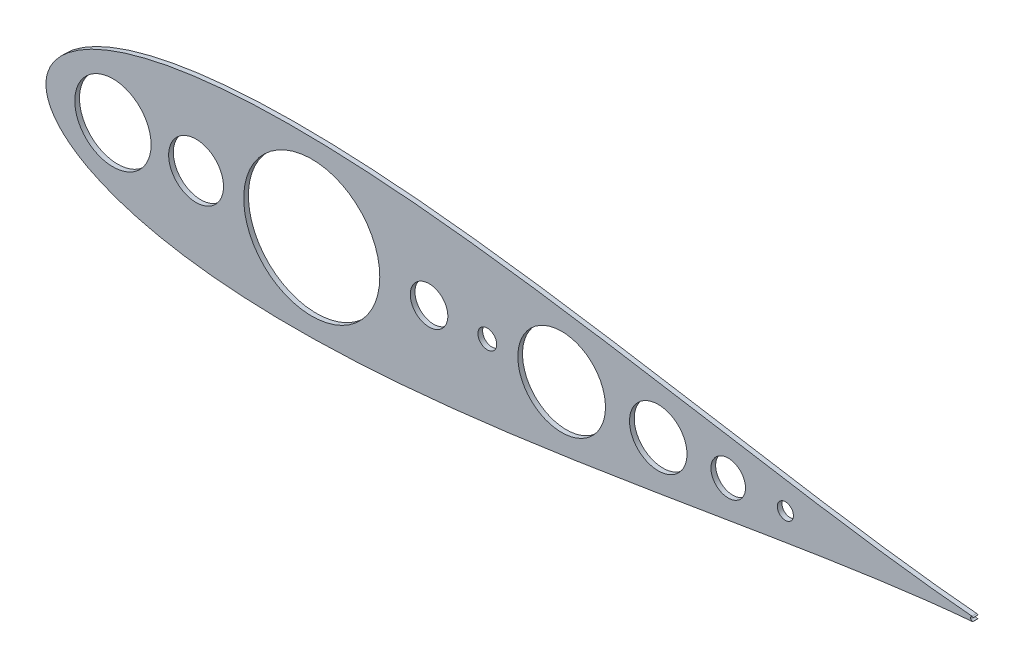
ISO-10303-21;
HEADER;
FILE_DESCRIPTION(('STEP AP214'),'2;1');
FILE_NAME('part.step','',(''),(''),'','','');
FILE_SCHEMA(('AUTOMOTIVE_DESIGN { 1 0 10303 214 1 1 1 1 }'));
ENDSEC;
DATA;
#1=APPLICATION_CONTEXT('core data for automotive mechanical design processes');
#2=APPLICATION_PROTOCOL_DEFINITION('international standard','automotive_design',2000,#1);
#3=PRODUCT_CONTEXT('',#1,'mechanical');
#4=PRODUCT('Part','Part','',(#3));
#5=PRODUCT_RELATED_PRODUCT_CATEGORY('part','',(#4));
#6=PRODUCT_DEFINITION_FORMATION('','',#4);
#7=PRODUCT_DEFINITION_CONTEXT('part definition',#1,'design');
#8=PRODUCT_DEFINITION('design','',#6,#7);
#9=PRODUCT_DEFINITION_SHAPE('','',#8);
#10=(LENGTH_UNIT() NAMED_UNIT(*) SI_UNIT(.MILLI.,.METRE.));
#11=(NAMED_UNIT(*) PLANE_ANGLE_UNIT() SI_UNIT($,.RADIAN.));
#12=(NAMED_UNIT(*) SI_UNIT($,.STERADIAN.) SOLID_ANGLE_UNIT());
#13=UNCERTAINTY_MEASURE_WITH_UNIT(LENGTH_MEASURE(1.E-05),#10,'distance_accuracy_value','');
#14=(GEOMETRIC_REPRESENTATION_CONTEXT(3) GLOBAL_UNCERTAINTY_ASSIGNED_CONTEXT((#13)) GLOBAL_UNIT_ASSIGNED_CONTEXT((#10,
#11,#12)) REPRESENTATION_CONTEXT('',''));
#15=CARTESIAN_POINT('',(0.,0.,0.));
#16=DIRECTION('',(0.,0.,1.));
#17=DIRECTION('',(1.,0.,0.));
#18=AXIS2_PLACEMENT_3D('',#15,#16,#17);
#19=CARTESIAN_POINT('',(748.376242259365,1063.5749912367,4.8259999999993));
#20=DIRECTION('',(0.,0.,1.));
#21=DIRECTION('',(1.,0.,0.));
#22=AXIS2_PLACEMENT_3D('',#19,#20,#21);
#23=PLANE('',#22);
#24=CARTESIAN_POINT('',(1227.93191847812,1063.57499124054,4.8259999999993));
#25=DIRECTION('',(0.,0.,1.));
#26=DIRECTION('',(1.,0.,0.));
#27=AXIS2_PLACEMENT_3D('',#24,#25,#26);
#28=CIRCLE('',#27,12.1531669388109);
#29=CARTESIAN_POINT('',(1240.08508541693,1063.57499124054,4.8259999999993));
#30=VERTEX_POINT('',#29);
#31=EDGE_CURVE('E164',#30,#30,#28,.T.);
#32=ORIENTED_EDGE('',*,*,#31,.F.);
#33=EDGE_LOOP('',(#32));
#34=FACE_BOUND('',#33,.T.);
#35=CARTESIAN_POINT('',(1268.10083221684,1063.57499124054,4.8259999999993));
#36=DIRECTION('',(0.,0.,1.));
#37=DIRECTION('',(1.,0.,0.));
#38=AXIS2_PLACEMENT_3D('',#35,#36,#37);
#39=CIRCLE('',#38,5.66053699436423);
#40=CARTESIAN_POINT('',(1273.7613692112,1063.57499124054,4.8259999999993));
#41=VERTEX_POINT('',#40);
#42=EDGE_CURVE('E152',#41,#41,#39,.T.);
#43=ORIENTED_EDGE('',*,*,#42,.F.);
#44=EDGE_LOOP('',(#43));
#45=FACE_BOUND('',#44,.T.);
#46=CARTESIAN_POINT('',(1110.85176199668,1063.57499124054,4.8259999999993));
#47=DIRECTION('',(0.,0.,1.));
#48=DIRECTION('',(1.,0.,0.));
#49=AXIS2_PLACEMENT_3D('',#46,#47,#48);
#50=CIRCLE('',#49,30.8016293145973);
#51=CARTESIAN_POINT('',(1141.65339131128,1063.57499124054,4.8259999999993));
#52=VERTEX_POINT('',#51);
#53=EDGE_CURVE('E140',#52,#52,#50,.T.);
#54=ORIENTED_EDGE('',*,*,#53,.F.);
#55=EDGE_LOOP('',(#54));
#56=FACE_BOUND('',#55,.T.);
#57=CARTESIAN_POINT('',(1017.64509665443,1063.57499124054,4.8259999999993));
#58=DIRECTION('',(0.,0.,1.));
#59=DIRECTION('',(1.,0.,0.));
#60=AXIS2_PLACEMENT_3D('',#57,#58,#59);
#61=CIRCLE('',#60,13.2079999999999);
#62=CARTESIAN_POINT('',(1030.85309665443,1063.57499124054,4.8259999999993));
#63=VERTEX_POINT('',#62);
#64=EDGE_CURVE('E128',#63,#63,#61,.T.);
#65=ORIENTED_EDGE('',*,*,#64,.F.);
#66=EDGE_LOOP('',(#65));
#67=FACE_BOUND('',#66,.T.);
#68=CARTESIAN_POINT('',(1399.21403215004,1065.17753357978,4.8259999999993));
#69=CARTESIAN_POINT('',(1398.68986897878,1065.22112278264,4.8259999999993));
#70=CARTESIAN_POINT('',(1394.73966540836,1065.55385560559,4.8259999999993));
#71=CARTESIAN_POINT('',(1386.96022279561,1066.27289420591,4.8259999999993));
#72=CARTESIAN_POINT('',(1375.41278950201,1067.47413122827,4.8259999999993));
#73=CARTESIAN_POINT('',(1362.60985062287,1068.94816561975,4.8259999999993));
#74=CARTESIAN_POINT('',(1348.59953401139,1070.70383389219,4.8259999999993));
#75=CARTESIAN_POINT('',(1333.44720383978,1072.74292362821,4.8259999999993));
#76=CARTESIAN_POINT('',(1317.21838594258,1075.06086325995,4.8259999999993));
#77=CARTESIAN_POINT('',(1299.98335696445,1077.64567963487,4.8259999999993));
#78=CARTESIAN_POINT('',(1281.81530521878,1080.47898485063,4.8259999999993));
#79=CARTESIAN_POINT('',(1262.7903442125,1083.53548114679,4.8259999999993));
#80=CARTESIAN_POINT('',(1242.98709647316,1086.78359911451,4.8259999999993));
#81=CARTESIAN_POINT('',(1222.48646499978,1090.18589214819,4.8259999999993));
#82=CARTESIAN_POINT('',(1201.37137112695,1093.69941620497,4.8259999999993));
#83=CARTESIAN_POINT('',(1179.72661557348,1097.27649875794,4.8259999999993));
#84=CARTESIAN_POINT('',(1157.63873897044,1100.86531112004,4.8259999999993));
#85=CARTESIAN_POINT('',(1135.19594890555,1104.4107180316,4.8259999999993));
#86=CARTESIAN_POINT('',(1112.4880721156,1107.85502076182,4.8259999999993));
#87=CARTESIAN_POINT('',(1089.60655090159,1111.1389812925,4.8259999999993));
#88=CARTESIAN_POINT('',(1066.64443242118,1114.20257390872,4.8259999999993));
#89=CARTESIAN_POINT('',(1043.6963912728,1116.98605509723,4.8259999999993));
#90=CARTESIAN_POINT('',(1020.85874522012,1119.43082221343,4.8259999999993));
#91=CARTESIAN_POINT('',(998.229469909467,1121.48044833112,4.8259999999993));
#92=CARTESIAN_POINT('',(975.908189513794,1123.08150536715,4.8259999999993));
#93=CARTESIAN_POINT('',(953.996174794857,1124.18456315417,4.8259999999993));
#94=CARTESIAN_POINT('',(932.596321074112,1124.74511945842,4.8259999999993));
#95=CARTESIAN_POINT('',(911.813113230117,1124.7243083796,4.8259999999993));
#96=CARTESIAN_POINT('',(891.752660845748,1124.08911611092,4.8259999999993));
#97=CARTESIAN_POINT('',(872.522699867532,1122.81467292556,4.8259999999993));
#98=CARTESIAN_POINT('',(854.232905668577,1120.8824981479,4.8259999999993));
#99=CARTESIAN_POINT('',(836.995066737044,1118.28388223604,4.8259999999993));
#100=CARTESIAN_POINT('',(820.924129603793,1115.01791362565,4.8259999999993));
#101=CARTESIAN_POINT('',(806.138979262097,1111.09552086041,4.8259999999993));
#102=CARTESIAN_POINT('',(792.76460967751,1106.53969212868,4.8259999999993));
#103=CARTESIAN_POINT('',(780.934443220543,1101.39102062956,4.8259999999993));
#104=CARTESIAN_POINT('',(770.792142866269,1095.71768623671,4.8259999999993));
#105=CARTESIAN_POINT('',(762.489229992148,1089.63481764354,4.8259999999993));
#106=CARTESIAN_POINT('',(756.165516178162,1083.34109003952,4.8259999999993));
#107=CARTESIAN_POINT('',(751.884260849463,1077.16927345065,4.8259999999993));
#108=CARTESIAN_POINT('',(749.496913565561,1071.60106779849,4.8259999999993));
#109=CARTESIAN_POINT('',(748.532857607036,1067.1343266559,4.8259999999993));
#110=CARTESIAN_POINT('',(748.313285177054,1063.5749912367,4.8259999999993));
#111=CARTESIAN_POINT('',(748.532857607036,1060.01565581749,4.8259999999993));
#112=CARTESIAN_POINT('',(749.496913565561,1055.5489146749,4.8259999999993));
#113=CARTESIAN_POINT('',(751.884260849463,1049.98070902275,4.8259999999993));
#114=CARTESIAN_POINT('',(756.165516178162,1043.80889243388,4.8259999999993));
#115=CARTESIAN_POINT('',(762.489229992148,1037.51516482985,4.8259999999993));
#116=CARTESIAN_POINT('',(770.792142866269,1031.43229623668,4.8259999999993));
#117=CARTESIAN_POINT('',(780.934443220543,1025.75896184384,4.8259999999993));
#118=CARTESIAN_POINT('',(792.76460967751,1020.61029034471,4.8259999999993));
#119=CARTESIAN_POINT('',(806.138979262097,1016.05446161298,4.8259999999993));
#120=CARTESIAN_POINT('',(820.924129603793,1012.13206884774,4.8259999999993));
#121=CARTESIAN_POINT('',(836.995066737044,1008.86610023735,4.8259999999993));
#122=CARTESIAN_POINT('',(854.232905668577,1006.26748432549,4.8259999999993));
#123=CARTESIAN_POINT('',(872.522699867532,1004.33530954783,4.8259999999993));
#124=CARTESIAN_POINT('',(891.752660845748,1003.06086636248,4.8259999999993));
#125=CARTESIAN_POINT('',(911.813113230117,1002.4256740938,4.8259999999993));
#126=CARTESIAN_POINT('',(932.596321074111,1002.40486301498,4.8259999999993));
#127=CARTESIAN_POINT('',(953.996174794857,1002.96541931923,4.8259999999993));
#128=CARTESIAN_POINT('',(975.908189513794,1004.06847710625,4.8259999999993));
#129=CARTESIAN_POINT('',(998.229469909467,1005.66953414227,4.8259999999993));
#130=CARTESIAN_POINT('',(1020.85874522012,1007.71916025996,4.8259999999993));
#131=CARTESIAN_POINT('',(1043.6963912728,1010.16392737616,4.8259999999993));
#132=CARTESIAN_POINT('',(1066.64443242118,1012.94740856467,4.8259999999993));
#133=CARTESIAN_POINT('',(1089.60655090159,1016.0110011809,4.8259999999993));
#134=CARTESIAN_POINT('',(1112.4880721156,1019.29496171158,4.8259999999993));
#135=CARTESIAN_POINT('',(1135.19594890555,1022.73926444179,4.8259999999993));
#136=CARTESIAN_POINT('',(1157.63873897044,1026.28467135335,4.8259999999993));
#137=CARTESIAN_POINT('',(1179.72661557348,1029.87348371545,4.8259999999993));
#138=CARTESIAN_POINT('',(1201.37137112695,1033.45056626843,4.8259999999993));
#139=CARTESIAN_POINT('',(1222.48646499978,1036.96409032521,4.8259999999993));
#140=CARTESIAN_POINT('',(1242.98709647316,1040.36638335889,4.8259999999993));
#141=CARTESIAN_POINT('',(1262.7903442125,1043.6145013266,4.8259999999993));
#142=CARTESIAN_POINT('',(1281.81530521878,1046.67099762277,4.8259999999993));
#143=CARTESIAN_POINT('',(1299.98335696444,1049.50430283852,4.8259999999993));
#144=CARTESIAN_POINT('',(1317.21838594258,1052.08911921345,4.8259999999993));
#145=CARTESIAN_POINT('',(1333.44720383978,1054.40705884519,4.8259999999993));
#146=CARTESIAN_POINT('',(1348.59953401139,1056.4461485812,4.8259999999993));
#147=CARTESIAN_POINT('',(1362.60985062287,1058.20181685364,4.8259999999993));
#148=CARTESIAN_POINT('',(1375.41278950201,1059.67585124513,4.8259999999993));
#149=CARTESIAN_POINT('',(1386.96022279561,1060.87708826749,4.8259999999993));
#150=CARTESIAN_POINT('',(1394.73966540837,1061.59612686781,4.8259999999993));
#151=CARTESIAN_POINT('',(1398.68986897878,1061.92885969076,4.8259999999993));
#152=CARTESIAN_POINT('',(1399.21403215004,1061.97244890131,4.8259999999993));
#153=B_SPLINE_CURVE_WITH_KNOTS('',3,(#68,#69,#70,#71,#72,#73,#74,#75,#76,#77,#78,#79,#80,#81,
#82,#83,#84,#85,#86,#87,#88,#89,#90,#91,#92,#93,#94,#95,#96,#97,#98,#99,#100,#101,#102,#103,
#104,#105,#106,#107,#108,#109,#110,#111,#112,#113,#114,#115,#116,#117,#118,#119,#120,#121,#122,
#123,#124,#125,#126,#127,#128,#129,#130,#131,#132,#133,#134,#135,#136,#137,#138,#139,#140,#141,
#142,#143,#144,#145,#146,#147,#148,#149,#150,#151,#152),.UNSPECIFIED.,.F.,.F.,(4,1,1,1,1,1,1,1,
1,1,1,1,1,1,1,1,1,1,1,1,1,1,1,1,1,1,1,1,1,1,1,1,1,1,1,1,1,1,1,1,1,1,1,1,1,1,1,1,1,1,1,1,1,1,1,1,
1,1,1,1,1,1,1,1,1,1,1,1,1,1,1,1,1,1,1,1,1,1,1,1,1,1,4),(0.020157042076269,0.0212708876900959,
0.0285525550130683,0.0367806836725549,0.0459201019032637,0.0559317636633187,0.0667728836144854,
0.0783971303496518,0.0907548266908363,0.103793164577546,0.117456431914319,0.131686225652521,
0.146421738497113,0.161599998000845,0.177156132626574,0.193023668070302,0.209134785631037,
0.225420632511523,0.241811601924249,0.258237646860869,0.274628556698349,0.290914287398014,
0.307025228908797,0.322892517177238,0.33844834182358,0.353626206573582,0.368361231970712,
0.382590427827798,0.396252960572084,0.40929041186716,0.421647009590257,0.433269881487031,
0.444109248914041,0.454118639688981,0.463255054987312,0.471479113777303,0.478755288570903,
0.485052318112802,0.490344025694165,0.494609832614287,0.497833231437255,0.5,0.502166768562745,
0.505390167385713,0.509655974305835,0.514947681887198,0.521244711429097,0.528520886222697,
0.536744945012688,0.545881360311019,0.555890751085959,0.566730118512969,0.578352990409744,
0.59070958813284,0.603747039427916,0.617409572172202,0.631638768029288,0.646373793426418,
0.66155165817642,0.677107482822761,0.692974771091203,0.709085712601986,0.725371443301651,
0.741762353139131,0.758188398075751,0.774579367488477,0.790865214368963,0.806976331929698,
0.822843867373426,0.838400001999155,0.853578261502887,0.868313774347479,0.882543568085681,
0.896206835422454,0.909245173309164,0.921602869650348,0.933227116385514,0.944068236336681,
0.954079898096736,0.963219316327445,0.971447444986932,0.978729112309904,0.979842957923731),.UNSPECIFIED.);
#154=CARTESIAN_POINT('',(1399.21403215004,1065.17753357978,4.8259999999993));
#155=VERTEX_POINT('',#154);
#156=CARTESIAN_POINT('',(1399.21403215004,1061.97244890131,4.8259999999993));
#157=VERTEX_POINT('',#156);
#158=EDGE_CURVE('E88',#155,#157,#153,.T.);
#159=ORIENTED_EDGE('',*,*,#158,.T.);
#160=CARTESIAN_POINT('',(1399.08076534834,1063.57499124054,4.8259999999993));
#161=DIRECTION('',(0.,0.,1.));
#162=DIRECTION('',(1.,0.,0.));
#163=AXIS2_PLACEMENT_3D('',#160,#161,#162);
#164=CIRCLE('',#163,1.60807399999997);
#165=CARTESIAN_POINT('',(1400.21816349308,1062.4382294142,4.8259999999993));
#166=VERTEX_POINT('',#165);
#167=EDGE_CURVE('E83',#157,#166,#164,.T.);
#168=ORIENTED_EDGE('',*,*,#167,.T.);
#169=CARTESIAN_POINT('',(1399.58543738621,1063.57499124054,4.8259999999993));
#170=DIRECTION('',(0.,0.,-1.));
#171=DIRECTION('',(1.,0.,0.));
#172=AXIS2_PLACEMENT_3D('',#169,#170,#171);
#173=CIRCLE('',#172,1.30098799999987);
#174=CARTESIAN_POINT('',(1400.21816349308,1064.71175306688,4.8259999999993));
#175=VERTEX_POINT('',#174);
#176=EDGE_CURVE('E86',#166,#175,#173,.T.);
#177=ORIENTED_EDGE('',*,*,#176,.T.);
#178=CARTESIAN_POINT('',(1399.08076534834,1063.57499124054,4.8259999999993));
#179=DIRECTION('',(0.,0.,1.));
#180=DIRECTION('',(1.,0.,0.));
#181=AXIS2_PLACEMENT_3D('',#178,#179,#180);
#182=CIRCLE('',#181,1.60807399999997);
#183=EDGE_CURVE('E53',#175,#155,#182,.T.);
#184=ORIENTED_EDGE('',*,*,#183,.T.);
#185=EDGE_LOOP('',(#159,#168,#177,#184));
#186=FACE_BOUND('',#185,.T.);
#187=CARTESIAN_POINT('',(795.427523384394,1063.57499124054,4.8259999999993));
#188=DIRECTION('',(0.,0.,1.));
#189=DIRECTION('',(1.,0.,0.));
#190=AXIS2_PLACEMENT_3D('',#187,#188,#189);
#191=CIRCLE('',#190,26.817658806615);
#192=CARTESIAN_POINT('',(822.245182191009,1063.57499124054,4.8259999999993));
#193=VERTEX_POINT('',#192);
#194=EDGE_CURVE('E104',#193,#193,#191,.T.);
#195=ORIENTED_EDGE('',*,*,#194,.F.);
#196=EDGE_LOOP('',(#195));
#197=FACE_BOUND('',#196,.T.);
#198=CARTESIAN_POINT('',(1178.74951303372,1063.57499124054,4.8259999999993));
#199=DIRECTION('',(0.,0.,1.));
#200=DIRECTION('',(1.,0.,0.));
#201=AXIS2_PLACEMENT_3D('',#198,#199,#200);
#202=CIRCLE('',#201,20.196730963613);
#203=CARTESIAN_POINT('',(1198.94624399734,1063.57499124054,4.8259999999993));
#204=VERTEX_POINT('',#203);
#205=EDGE_CURVE('E134',#204,#204,#202,.T.);
#206=ORIENTED_EDGE('',*,*,#205,.F.);
#207=EDGE_LOOP('',(#206));
#208=FACE_BOUND('',#207,.T.);
#209=CARTESIAN_POINT('',(935.182452031255,1063.57499124054,4.8259999999993));
#210=DIRECTION('',(0.,0.,1.));
#211=DIRECTION('',(1.,0.,0.));
#212=AXIS2_PLACEMENT_3D('',#209,#210,#211);
#213=CIRCLE('',#212,47.8209397931393);
#214=CARTESIAN_POINT('',(983.003391824394,1063.57499124054,4.8259999999993));
#215=VERTEX_POINT('',#214);
#216=EDGE_CURVE('E146',#215,#215,#213,.T.);
#217=ORIENTED_EDGE('',*,*,#216,.F.);
#218=EDGE_LOOP('',(#217));
#219=FACE_BOUND('',#218,.T.);
#220=CARTESIAN_POINT('',(853.865896654429,1063.57499124054,4.8259999999993));
#221=DIRECTION('',(0.,0.,1.));
#222=DIRECTION('',(1.,0.,0.));
#223=AXIS2_PLACEMENT_3D('',#220,#221,#222);
#224=CIRCLE('',#223,19.2836800000001);
#225=CARTESIAN_POINT('',(873.149576654429,1063.57499124054,4.8259999999993));
#226=VERTEX_POINT('',#225);
#227=EDGE_CURVE('E158',#226,#226,#224,.T.);
#228=ORIENTED_EDGE('',*,*,#227,.F.);
#229=EDGE_LOOP('',(#228));
#230=FACE_BOUND('',#229,.T.);
#231=CARTESIAN_POINT('',(1058.58989665443,1063.57499124054,4.8259999999993));
#232=DIRECTION('',(0.,0.,1.));
#233=DIRECTION('',(1.,0.,0.));
#234=AXIS2_PLACEMENT_3D('',#231,#232,#233);
#235=CIRCLE('',#234,6.60400000000008);
#236=CARTESIAN_POINT('',(1065.19389665443,1063.57499124054,4.8259999999993));
#237=VERTEX_POINT('',#236);
#238=EDGE_CURVE('E170',#237,#237,#235,.T.);
#239=ORIENTED_EDGE('',*,*,#238,.F.);
#240=EDGE_LOOP('',(#239));
#241=FACE_BOUND('',#240,.T.);
#242=ADVANCED_FACE('F35',(#34,#45,#56,#67,#186,#197,#208,#219,#230,#241),#23,.T.);
#243=CARTESIAN_POINT('',(748.376242259365,1063.5749912367,1.52399999999929));
#244=DIRECTION('',(0.,0.,1.));
#245=DIRECTION('',(1.,0.,0.));
#246=AXIS2_PLACEMENT_3D('',#243,#244,#245);
#247=PLANE('',#246);
#248=CARTESIAN_POINT('',(1399.21403215004,1065.17753357978,1.52399999999929));
#249=CARTESIAN_POINT('',(1398.68986897878,1065.22112278264,1.52399999999929));
#250=CARTESIAN_POINT('',(1394.73966540836,1065.55385560559,1.52399999999929));
#251=CARTESIAN_POINT('',(1386.96022279561,1066.27289420591,1.52399999999929));
#252=CARTESIAN_POINT('',(1375.41278950201,1067.47413122827,1.52399999999929));
#253=CARTESIAN_POINT('',(1362.60985062287,1068.94816561975,1.52399999999929));
#254=CARTESIAN_POINT('',(1348.59953401139,1070.70383389219,1.52399999999929));
#255=CARTESIAN_POINT('',(1333.44720383978,1072.74292362821,1.52399999999929));
#256=CARTESIAN_POINT('',(1317.21838594258,1075.06086325995,1.52399999999929));
#257=CARTESIAN_POINT('',(1299.98335696445,1077.64567963487,1.52399999999929));
#258=CARTESIAN_POINT('',(1281.81530521878,1080.47898485063,1.52399999999929));
#259=CARTESIAN_POINT('',(1262.7903442125,1083.53548114679,1.52399999999929));
#260=CARTESIAN_POINT('',(1242.98709647316,1086.78359911451,1.52399999999929));
#261=CARTESIAN_POINT('',(1222.48646499978,1090.18589214819,1.52399999999929));
#262=CARTESIAN_POINT('',(1201.37137112695,1093.69941620497,1.52399999999929));
#263=CARTESIAN_POINT('',(1179.72661557348,1097.27649875794,1.52399999999929));
#264=CARTESIAN_POINT('',(1157.63873897044,1100.86531112004,1.52399999999929));
#265=CARTESIAN_POINT('',(1135.19594890555,1104.4107180316,1.52399999999929));
#266=CARTESIAN_POINT('',(1112.4880721156,1107.85502076182,1.52399999999929));
#267=CARTESIAN_POINT('',(1089.60655090159,1111.1389812925,1.52399999999929));
#268=CARTESIAN_POINT('',(1066.64443242118,1114.20257390872,1.52399999999929));
#269=CARTESIAN_POINT('',(1043.6963912728,1116.98605509723,1.52399999999929));
#270=CARTESIAN_POINT('',(1020.85874522012,1119.43082221343,1.52399999999929));
#271=CARTESIAN_POINT('',(998.229469909467,1121.48044833112,1.52399999999929));
#272=CARTESIAN_POINT('',(975.908189513794,1123.08150536715,1.52399999999929));
#273=CARTESIAN_POINT('',(953.996174794857,1124.18456315417,1.52399999999929));
#274=CARTESIAN_POINT('',(932.596321074112,1124.74511945842,1.52399999999929));
#275=CARTESIAN_POINT('',(911.813113230117,1124.7243083796,1.52399999999929));
#276=CARTESIAN_POINT('',(891.752660845748,1124.08911611092,1.52399999999929));
#277=CARTESIAN_POINT('',(872.522699867532,1122.81467292556,1.52399999999929));
#278=CARTESIAN_POINT('',(854.232905668577,1120.8824981479,1.52399999999929));
#279=CARTESIAN_POINT('',(836.995066737044,1118.28388223604,1.52399999999929));
#280=CARTESIAN_POINT('',(820.924129603793,1115.01791362565,1.52399999999929));
#281=CARTESIAN_POINT('',(806.138979262097,1111.09552086041,1.52399999999929));
#282=CARTESIAN_POINT('',(792.76460967751,1106.53969212868,1.52399999999929));
#283=CARTESIAN_POINT('',(780.934443220543,1101.39102062956,1.52399999999929));
#284=CARTESIAN_POINT('',(770.792142866269,1095.71768623671,1.52399999999929));
#285=CARTESIAN_POINT('',(762.489229992148,1089.63481764354,1.52399999999929));
#286=CARTESIAN_POINT('',(756.165516178162,1083.34109003952,1.52399999999929));
#287=CARTESIAN_POINT('',(751.884260849463,1077.16927345065,1.52399999999929));
#288=CARTESIAN_POINT('',(749.496913565561,1071.60106779849,1.52399999999929));
#289=CARTESIAN_POINT('',(748.532857607036,1067.1343266559,1.52399999999929));
#290=CARTESIAN_POINT('',(748.313285177054,1063.5749912367,1.52399999999929));
#291=CARTESIAN_POINT('',(748.532857607036,1060.01565581749,1.52399999999929));
#292=CARTESIAN_POINT('',(749.496913565561,1055.5489146749,1.52399999999929));
#293=CARTESIAN_POINT('',(751.884260849463,1049.98070902275,1.52399999999929));
#294=CARTESIAN_POINT('',(756.165516178162,1043.80889243388,1.52399999999929));
#295=CARTESIAN_POINT('',(762.489229992148,1037.51516482985,1.52399999999929));
#296=CARTESIAN_POINT('',(770.792142866269,1031.43229623668,1.52399999999929));
#297=CARTESIAN_POINT('',(780.934443220543,1025.75896184384,1.52399999999929));
#298=CARTESIAN_POINT('',(792.76460967751,1020.61029034471,1.52399999999929));
#299=CARTESIAN_POINT('',(806.138979262097,1016.05446161298,1.52399999999929));
#300=CARTESIAN_POINT('',(820.924129603793,1012.13206884774,1.52399999999929));
#301=CARTESIAN_POINT('',(836.995066737044,1008.86610023735,1.52399999999929));
#302=CARTESIAN_POINT('',(854.232905668577,1006.26748432549,1.52399999999929));
#303=CARTESIAN_POINT('',(872.522699867532,1004.33530954783,1.52399999999929));
#304=CARTESIAN_POINT('',(891.752660845748,1003.06086636248,1.52399999999929));
#305=CARTESIAN_POINT('',(911.813113230117,1002.4256740938,1.52399999999929));
#306=CARTESIAN_POINT('',(932.596321074111,1002.40486301498,1.52399999999929));
#307=CARTESIAN_POINT('',(953.996174794857,1002.96541931923,1.52399999999929));
#308=CARTESIAN_POINT('',(975.908189513794,1004.06847710625,1.52399999999929));
#309=CARTESIAN_POINT('',(998.229469909467,1005.66953414227,1.52399999999929));
#310=CARTESIAN_POINT('',(1020.85874522012,1007.71916025996,1.52399999999929));
#311=CARTESIAN_POINT('',(1043.6963912728,1010.16392737616,1.52399999999929));
#312=CARTESIAN_POINT('',(1066.64443242118,1012.94740856467,1.52399999999929));
#313=CARTESIAN_POINT('',(1089.60655090159,1016.0110011809,1.52399999999929));
#314=CARTESIAN_POINT('',(1112.4880721156,1019.29496171158,1.52399999999929));
#315=CARTESIAN_POINT('',(1135.19594890555,1022.73926444179,1.52399999999929));
#316=CARTESIAN_POINT('',(1157.63873897044,1026.28467135335,1.52399999999929));
#317=CARTESIAN_POINT('',(1179.72661557348,1029.87348371545,1.52399999999929));
#318=CARTESIAN_POINT('',(1201.37137112695,1033.45056626843,1.52399999999929));
#319=CARTESIAN_POINT('',(1222.48646499978,1036.96409032521,1.52399999999929));
#320=CARTESIAN_POINT('',(1242.98709647316,1040.36638335889,1.52399999999929));
#321=CARTESIAN_POINT('',(1262.7903442125,1043.6145013266,1.52399999999929));
#322=CARTESIAN_POINT('',(1281.81530521878,1046.67099762277,1.52399999999929));
#323=CARTESIAN_POINT('',(1299.98335696444,1049.50430283852,1.52399999999929));
#324=CARTESIAN_POINT('',(1317.21838594258,1052.08911921345,1.52399999999929));
#325=CARTESIAN_POINT('',(1333.44720383978,1054.40705884519,1.52399999999929));
#326=CARTESIAN_POINT('',(1348.59953401139,1056.4461485812,1.52399999999929));
#327=CARTESIAN_POINT('',(1362.60985062287,1058.20181685364,1.52399999999929));
#328=CARTESIAN_POINT('',(1375.41278950201,1059.67585124513,1.52399999999929));
#329=CARTESIAN_POINT('',(1386.96022279561,1060.87708826749,1.52399999999929));
#330=CARTESIAN_POINT('',(1394.73966540837,1061.59612686781,1.52399999999929));
#331=CARTESIAN_POINT('',(1398.68986897878,1061.92885969076,1.52399999999929));
#332=CARTESIAN_POINT('',(1399.21403215004,1061.97244890131,1.52399999999929));
#333=B_SPLINE_CURVE_WITH_KNOTS('',3,(#248,#249,#250,#251,#252,#253,#254,#255,#256,#257,#258,
#259,#260,#261,#262,#263,#264,#265,#266,#267,#268,#269,#270,#271,#272,#273,#274,#275,#276,#277,
#278,#279,#280,#281,#282,#283,#284,#285,#286,#287,#288,#289,#290,#291,#292,#293,#294,#295,#296,
#297,#298,#299,#300,#301,#302,#303,#304,#305,#306,#307,#308,#309,#310,#311,#312,#313,#314,#315,
#316,#317,#318,#319,#320,#321,#322,#323,#324,#325,#326,#327,#328,#329,#330,#331,#332),
.UNSPECIFIED.,.F.,.F.,(4,1,1,1,1,1,1,1,1,1,1,1,1,1,1,1,1,1,1,1,1,1,1,1,1,1,1,1,1,1,1,1,1,1,1,1,
1,1,1,1,1,1,1,1,1,1,1,1,1,1,1,1,1,1,1,1,1,1,1,1,1,1,1,1,1,1,1,1,1,1,1,1,1,1,1,1,1,1,1,1,1,1,4),
(0.020157042076269,0.0212708876900959,0.0285525550130683,0.0367806836725549,0.0459201019032637,
0.0559317636633187,0.0667728836144854,0.0783971303496518,0.0907548266908363,0.103793164577546,
0.117456431914319,0.131686225652521,0.146421738497113,0.161599998000845,0.177156132626574,
0.193023668070302,0.209134785631037,0.225420632511523,0.241811601924249,0.258237646860869,
0.274628556698349,0.290914287398014,0.307025228908797,0.322892517177238,0.33844834182358,
0.353626206573582,0.368361231970712,0.382590427827798,0.396252960572084,0.40929041186716,
0.421647009590257,0.433269881487031,0.444109248914041,0.454118639688981,0.463255054987312,
0.471479113777303,0.478755288570903,0.485052318112802,0.490344025694165,0.494609832614287,
0.497833231437255,0.5,0.502166768562745,0.505390167385713,0.509655974305835,0.514947681887198,
0.521244711429097,0.528520886222697,0.536744945012688,0.545881360311019,0.555890751085959,
0.566730118512969,0.578352990409744,0.59070958813284,0.603747039427916,0.617409572172202,
0.631638768029288,0.646373793426418,0.66155165817642,0.677107482822761,0.692974771091203,
0.709085712601986,0.725371443301651,0.741762353139131,0.758188398075751,0.774579367488477,
0.790865214368963,0.806976331929698,0.822843867373426,0.838400001999155,0.853578261502887,
0.868313774347479,0.882543568085681,0.896206835422454,0.909245173309164,0.921602869650348,
0.933227116385514,0.944068236336681,0.954079898096736,0.963219316327445,0.971447444986932,
0.978729112309904,0.979842957923731),.UNSPECIFIED.);
#334=CARTESIAN_POINT('',(1399.21403215004,1065.17753357978,1.52399999999929));
#335=VERTEX_POINT('',#334);
#336=CARTESIAN_POINT('',(1399.21403215004,1061.97244890131,1.52399999999929));
#337=VERTEX_POINT('',#336);
#338=EDGE_CURVE('E99',#335,#337,#333,.T.);
#339=ORIENTED_EDGE('',*,*,#338,.F.);
#340=CARTESIAN_POINT('',(1399.08076534834,1063.57499124054,1.52399999999929));
#341=DIRECTION('',(0.,0.,1.));
#342=DIRECTION('',(1.,0.,0.));
#343=AXIS2_PLACEMENT_3D('',#340,#341,#342);
#344=CIRCLE('',#343,1.60807399999997);
#345=CARTESIAN_POINT('',(1400.21816349308,1064.71175306688,1.52399999999929));
#346=VERTEX_POINT('',#345);
#347=EDGE_CURVE('E76',#346,#335,#344,.T.);
#348=ORIENTED_EDGE('',*,*,#347,.F.);
#349=CARTESIAN_POINT('',(1399.58543738621,1063.57499124054,1.52399999999929));
#350=DIRECTION('',(0.,0.,-1.));
#351=DIRECTION('',(1.,0.,0.));
#352=AXIS2_PLACEMENT_3D('',#349,#350,#351);
#353=CIRCLE('',#352,1.30098799999987);
#354=CARTESIAN_POINT('',(1400.21816349308,1062.4382294142,1.52399999999929));
#355=VERTEX_POINT('',#354);
#356=EDGE_CURVE('E70',#355,#346,#353,.T.);
#357=ORIENTED_EDGE('',*,*,#356,.F.);
#358=CARTESIAN_POINT('',(1399.08076534834,1063.57499124054,1.52399999999929));
#359=DIRECTION('',(0.,0.,1.));
#360=DIRECTION('',(1.,0.,0.));
#361=AXIS2_PLACEMENT_3D('',#358,#359,#360);
#362=CIRCLE('',#361,1.60807399999997);
#363=EDGE_CURVE('E92',#337,#355,#362,.T.);
#364=ORIENTED_EDGE('',*,*,#363,.F.);
#365=EDGE_LOOP('',(#339,#348,#357,#364));
#366=FACE_BOUND('',#365,.T.);
#367=CARTESIAN_POINT('',(795.427523384394,1063.57499124054,1.52399999999929));
#368=DIRECTION('',(0.,0.,1.));
#369=DIRECTION('',(1.,0.,0.));
#370=AXIS2_PLACEMENT_3D('',#367,#368,#369);
#371=CIRCLE('',#370,26.817658806615);
#372=CARTESIAN_POINT('',(822.245182191009,1063.57499124054,1.52399999999929));
#373=VERTEX_POINT('',#372);
#374=EDGE_CURVE('E122',#373,#373,#371,.T.);
#375=ORIENTED_EDGE('',*,*,#374,.T.);
#376=EDGE_LOOP('',(#375));
#377=FACE_BOUND('',#376,.T.);
#378=CARTESIAN_POINT('',(1017.64509665443,1063.57499124054,1.52399999999929));
#379=DIRECTION('',(0.,0.,1.));
#380=DIRECTION('',(1.,0.,0.));
#381=AXIS2_PLACEMENT_3D('',#378,#379,#380);
#382=CIRCLE('',#381,13.2079999999999);
#383=CARTESIAN_POINT('',(1030.85309665443,1063.57499124054,1.52399999999929));
#384=VERTEX_POINT('',#383);
#385=EDGE_CURVE('E131',#384,#384,#382,.T.);
#386=ORIENTED_EDGE('',*,*,#385,.T.);
#387=EDGE_LOOP('',(#386));
#388=FACE_BOUND('',#387,.T.);
#389=CARTESIAN_POINT('',(1178.74951303372,1063.57499124054,1.52399999999929));
#390=DIRECTION('',(0.,0.,1.));
#391=DIRECTION('',(1.,0.,0.));
#392=AXIS2_PLACEMENT_3D('',#389,#390,#391);
#393=CIRCLE('',#392,20.196730963613);
#394=CARTESIAN_POINT('',(1198.94624399734,1063.57499124054,1.52399999999929));
#395=VERTEX_POINT('',#394);
#396=EDGE_CURVE('E137',#395,#395,#393,.T.);
#397=ORIENTED_EDGE('',*,*,#396,.T.);
#398=EDGE_LOOP('',(#397));
#399=FACE_BOUND('',#398,.T.);
#400=CARTESIAN_POINT('',(1110.85176199668,1063.57499124054,1.52399999999929));
#401=DIRECTION('',(0.,0.,1.));
#402=DIRECTION('',(1.,0.,0.));
#403=AXIS2_PLACEMENT_3D('',#400,#401,#402);
#404=CIRCLE('',#403,30.8016293145973);
#405=CARTESIAN_POINT('',(1141.65339131128,1063.57499124054,1.52399999999929));
#406=VERTEX_POINT('',#405);
#407=EDGE_CURVE('E143',#406,#406,#404,.T.);
#408=ORIENTED_EDGE('',*,*,#407,.T.);
#409=EDGE_LOOP('',(#408));
#410=FACE_BOUND('',#409,.T.);
#411=CARTESIAN_POINT('',(935.182452031255,1063.57499124054,1.52399999999929));
#412=DIRECTION('',(0.,0.,1.));
#413=DIRECTION('',(1.,0.,0.));
#414=AXIS2_PLACEMENT_3D('',#411,#412,#413);
#415=CIRCLE('',#414,47.8209397931393);
#416=CARTESIAN_POINT('',(983.003391824394,1063.57499124054,1.52399999999929));
#417=VERTEX_POINT('',#416);
#418=EDGE_CURVE('E149',#417,#417,#415,.T.);
#419=ORIENTED_EDGE('',*,*,#418,.T.);
#420=EDGE_LOOP('',(#419));
#421=FACE_BOUND('',#420,.T.);
#422=CARTESIAN_POINT('',(1268.10083221684,1063.57499124054,1.52399999999929));
#423=DIRECTION('',(0.,0.,1.));
#424=DIRECTION('',(1.,0.,0.));
#425=AXIS2_PLACEMENT_3D('',#422,#423,#424);
#426=CIRCLE('',#425,5.66053699436423);
#427=CARTESIAN_POINT('',(1273.7613692112,1063.57499124054,1.52399999999929));
#428=VERTEX_POINT('',#427);
#429=EDGE_CURVE('E155',#428,#428,#426,.T.);
#430=ORIENTED_EDGE('',*,*,#429,.T.);
#431=EDGE_LOOP('',(#430));
#432=FACE_BOUND('',#431,.T.);
#433=CARTESIAN_POINT('',(853.865896654429,1063.57499124054,1.52399999999929));
#434=DIRECTION('',(0.,0.,1.));
#435=DIRECTION('',(1.,0.,0.));
#436=AXIS2_PLACEMENT_3D('',#433,#434,#435);
#437=CIRCLE('',#436,19.2836800000001);
#438=CARTESIAN_POINT('',(873.149576654429,1063.57499124054,1.52399999999929));
#439=VERTEX_POINT('',#438);
#440=EDGE_CURVE('E161',#439,#439,#437,.T.);
#441=ORIENTED_EDGE('',*,*,#440,.T.);
#442=EDGE_LOOP('',(#441));
#443=FACE_BOUND('',#442,.T.);
#444=CARTESIAN_POINT('',(1227.93191847812,1063.57499124054,1.52399999999929));
#445=DIRECTION('',(0.,0.,1.));
#446=DIRECTION('',(1.,0.,0.));
#447=AXIS2_PLACEMENT_3D('',#444,#445,#446);
#448=CIRCLE('',#447,12.1531669388109);
#449=CARTESIAN_POINT('',(1240.08508541693,1063.57499124054,1.52399999999929));
#450=VERTEX_POINT('',#449);
#451=EDGE_CURVE('E167',#450,#450,#448,.T.);
#452=ORIENTED_EDGE('',*,*,#451,.T.);
#453=EDGE_LOOP('',(#452));
#454=FACE_BOUND('',#453,.T.);
#455=CARTESIAN_POINT('',(1058.58989665443,1063.57499124054,1.52399999999929));
#456=DIRECTION('',(0.,0.,1.));
#457=DIRECTION('',(1.,0.,0.));
#458=AXIS2_PLACEMENT_3D('',#455,#456,#457);
#459=CIRCLE('',#458,6.60400000000008);
#460=CARTESIAN_POINT('',(1065.19389665443,1063.57499124054,1.52399999999929));
#461=VERTEX_POINT('',#460);
#462=EDGE_CURVE('E173',#461,#461,#459,.T.);
#463=ORIENTED_EDGE('',*,*,#462,.T.);
#464=EDGE_LOOP('',(#463));
#465=FACE_BOUND('',#464,.T.);
#466=ADVANCED_FACE('F115',(#366,#377,#388,#399,#410,#421,#432,#443,#454,#465),#247,.F.);
#467=DIRECTION('',(0.,0.,-1.));
#468=VECTOR('',#467,1.);
#469=SURFACE_OF_LINEAR_EXTRUSION('',#153,#468);
#470=ORIENTED_EDGE('',*,*,#338,.T.);
#471=DIRECTION('',(0.,0.,-1.));
#472=VECTOR('',#471,1.);
#473=CARTESIAN_POINT('',(1399.21403215004,1061.97244890131,4.8259999999993));
#474=LINE('',#473,#472);
#475=EDGE_CURVE('E11',#157,#337,#474,.T.);
#476=ORIENTED_EDGE('',*,*,#475,.F.);
#477=ORIENTED_EDGE('',*,*,#158,.F.);
#478=DIRECTION('',(0.,0.,-1.));
#479=VECTOR('',#478,1.);
#480=CARTESIAN_POINT('',(1399.21403215004,1065.17753357978,4.8259999999993));
#481=LINE('',#480,#479);
#482=EDGE_CURVE('E96',#155,#335,#481,.T.);
#483=ORIENTED_EDGE('',*,*,#482,.T.);
#484=EDGE_LOOP('',(#470,#476,#477,#483));
#485=FACE_BOUND('',#484,.T.);
#486=ADVANCED_FACE('F37',(#485),#469,.F.);
#487=CARTESIAN_POINT('',(1399.08076534834,1063.57499124054,4.8259999999993));
#488=DIRECTION('',(0.,0.,-1.));
#489=DIRECTION('',(-1.,0.,0.));
#490=AXIS2_PLACEMENT_3D('',#487,#488,#489);
#491=CYLINDRICAL_SURFACE('',#490,1.60807399999997);
#492=ORIENTED_EDGE('',*,*,#363,.T.);
#493=DIRECTION('',(0.,0.,-1.));
#494=VECTOR('',#493,1.);
#495=CARTESIAN_POINT('',(1400.21816349308,1062.4382294142,4.8259999999993));
#496=LINE('',#495,#494);
#497=EDGE_CURVE('E45',#166,#355,#496,.T.);
#498=ORIENTED_EDGE('',*,*,#497,.F.);
#499=ORIENTED_EDGE('',*,*,#167,.F.);
#500=ORIENTED_EDGE('',*,*,#475,.T.);
#501=EDGE_LOOP('',(#492,#498,#499,#500));
#502=FACE_BOUND('',#501,.T.);
#503=ADVANCED_FACE('F91',(#502),#491,.T.);
#504=CARTESIAN_POINT('',(1399.58543738621,1063.57499124054,4.8259999999993));
#505=DIRECTION('',(0.,0.,-1.));
#506=DIRECTION('',(-1.,0.,0.));
#507=AXIS2_PLACEMENT_3D('',#504,#505,#506);
#508=CYLINDRICAL_SURFACE('',#507,1.30098799999987);
#509=ORIENTED_EDGE('',*,*,#356,.T.);
#510=DIRECTION('',(0.,0.,-1.));
#511=VECTOR('',#510,1.);
#512=CARTESIAN_POINT('',(1400.21816349308,1064.71175306688,4.8259999999993));
#513=LINE('',#512,#511);
#514=EDGE_CURVE('E93',#175,#346,#513,.T.);
#515=ORIENTED_EDGE('',*,*,#514,.F.);
#516=ORIENTED_EDGE('',*,*,#176,.F.);
#517=ORIENTED_EDGE('',*,*,#497,.T.);
#518=EDGE_LOOP('',(#509,#515,#516,#517));
#519=FACE_BOUND('',#518,.T.);
#520=ADVANCED_FACE('F94',(#519),#508,.F.);
#521=CARTESIAN_POINT('',(1399.08076534834,1063.57499124054,4.8259999999993));
#522=DIRECTION('',(0.,0.,-1.));
#523=DIRECTION('',(-1.,0.,0.));
#524=AXIS2_PLACEMENT_3D('',#521,#522,#523);
#525=CYLINDRICAL_SURFACE('',#524,1.60807399999997);
#526=ORIENTED_EDGE('',*,*,#347,.T.);
#527=ORIENTED_EDGE('',*,*,#482,.F.);
#528=ORIENTED_EDGE('',*,*,#183,.F.);
#529=ORIENTED_EDGE('',*,*,#514,.T.);
#530=EDGE_LOOP('',(#526,#527,#528,#529));
#531=FACE_BOUND('',#530,.T.);
#532=ADVANCED_FACE('F112',(#531),#525,.T.);
#533=CARTESIAN_POINT('',(795.427523384394,1063.57499124054,4.8259999999993));
#534=DIRECTION('',(0.,0.,-1.));
#535=DIRECTION('',(-1.,0.,0.));
#536=AXIS2_PLACEMENT_3D('',#533,#534,#535);
#537=CYLINDRICAL_SURFACE('',#536,26.817658806615);
#538=ORIENTED_EDGE('',*,*,#194,.T.);
#539=EDGE_LOOP('',(#538));
#540=FACE_BOUND('',#539,.T.);
#541=ORIENTED_EDGE('',*,*,#374,.F.);
#542=EDGE_LOOP('',(#541));
#543=FACE_BOUND('',#542,.T.);
#544=ADVANCED_FACE('F192',(#540,#543),#537,.F.);
#545=CARTESIAN_POINT('',(1017.64509665443,1063.57499124054,4.8259999999993));
#546=DIRECTION('',(0.,0.,-1.));
#547=DIRECTION('',(-1.,0.,0.));
#548=AXIS2_PLACEMENT_3D('',#545,#546,#547);
#549=CYLINDRICAL_SURFACE('',#548,13.2079999999999);
#550=ORIENTED_EDGE('',*,*,#64,.T.);
#551=EDGE_LOOP('',(#550));
#552=FACE_BOUND('',#551,.T.);
#553=ORIENTED_EDGE('',*,*,#385,.F.);
#554=EDGE_LOOP('',(#553));
#555=FACE_BOUND('',#554,.T.);
#556=ADVANCED_FACE('F238',(#552,#555),#549,.F.);
#557=CARTESIAN_POINT('',(1178.74951303372,1063.57499124054,4.8259999999993));
#558=DIRECTION('',(0.,0.,-1.));
#559=DIRECTION('',(-1.,0.,0.));
#560=AXIS2_PLACEMENT_3D('',#557,#558,#559);
#561=CYLINDRICAL_SURFACE('',#560,20.196730963613);
#562=ORIENTED_EDGE('',*,*,#205,.T.);
#563=EDGE_LOOP('',(#562));
#564=FACE_BOUND('',#563,.T.);
#565=ORIENTED_EDGE('',*,*,#396,.F.);
#566=EDGE_LOOP('',(#565));
#567=FACE_BOUND('',#566,.T.);
#568=ADVANCED_FACE('F246',(#564,#567),#561,.F.);
#569=CARTESIAN_POINT('',(1110.85176199668,1063.57499124054,4.8259999999993));
#570=DIRECTION('',(0.,0.,-1.));
#571=DIRECTION('',(-1.,0.,0.));
#572=AXIS2_PLACEMENT_3D('',#569,#570,#571);
#573=CYLINDRICAL_SURFACE('',#572,30.8016293145973);
#574=ORIENTED_EDGE('',*,*,#53,.T.);
#575=EDGE_LOOP('',(#574));
#576=FACE_BOUND('',#575,.T.);
#577=ORIENTED_EDGE('',*,*,#407,.F.);
#578=EDGE_LOOP('',(#577));
#579=FACE_BOUND('',#578,.T.);
#580=ADVANCED_FACE('F254',(#576,#579),#573,.F.);
#581=CARTESIAN_POINT('',(935.182452031255,1063.57499124054,4.8259999999993));
#582=DIRECTION('',(0.,0.,-1.));
#583=DIRECTION('',(-1.,0.,0.));
#584=AXIS2_PLACEMENT_3D('',#581,#582,#583);
#585=CYLINDRICAL_SURFACE('',#584,47.8209397931393);
#586=ORIENTED_EDGE('',*,*,#216,.T.);
#587=EDGE_LOOP('',(#586));
#588=FACE_BOUND('',#587,.T.);
#589=ORIENTED_EDGE('',*,*,#418,.F.);
#590=EDGE_LOOP('',(#589));
#591=FACE_BOUND('',#590,.T.);
#592=ADVANCED_FACE('F263',(#588,#591),#585,.F.);
#593=CARTESIAN_POINT('',(1268.10083221684,1063.57499124054,4.8259999999993));
#594=DIRECTION('',(0.,0.,-1.));
#595=DIRECTION('',(-1.,0.,0.));
#596=AXIS2_PLACEMENT_3D('',#593,#594,#595);
#597=CYLINDRICAL_SURFACE('',#596,5.66053699436423);
#598=ORIENTED_EDGE('',*,*,#42,.T.);
#599=EDGE_LOOP('',(#598));
#600=FACE_BOUND('',#599,.T.);
#601=ORIENTED_EDGE('',*,*,#429,.F.);
#602=EDGE_LOOP('',(#601));
#603=FACE_BOUND('',#602,.T.);
#604=ADVANCED_FACE('F272',(#600,#603),#597,.F.);
#605=CARTESIAN_POINT('',(853.865896654429,1063.57499124054,4.8259999999993));
#606=DIRECTION('',(0.,0.,-1.));
#607=DIRECTION('',(-1.,0.,0.));
#608=AXIS2_PLACEMENT_3D('',#605,#606,#607);
#609=CYLINDRICAL_SURFACE('',#608,19.2836800000001);
#610=ORIENTED_EDGE('',*,*,#227,.T.);
#611=EDGE_LOOP('',(#610));
#612=FACE_BOUND('',#611,.T.);
#613=ORIENTED_EDGE('',*,*,#440,.F.);
#614=EDGE_LOOP('',(#613));
#615=FACE_BOUND('',#614,.T.);
#616=ADVANCED_FACE('F281',(#612,#615),#609,.F.);
#617=CARTESIAN_POINT('',(1227.93191847812,1063.57499124054,4.8259999999993));
#618=DIRECTION('',(0.,0.,-1.));
#619=DIRECTION('',(-1.,0.,0.));
#620=AXIS2_PLACEMENT_3D('',#617,#618,#619);
#621=CYLINDRICAL_SURFACE('',#620,12.1531669388109);
#622=ORIENTED_EDGE('',*,*,#31,.T.);
#623=EDGE_LOOP('',(#622));
#624=FACE_BOUND('',#623,.T.);
#625=ORIENTED_EDGE('',*,*,#451,.F.);
#626=EDGE_LOOP('',(#625));
#627=FACE_BOUND('',#626,.T.);
#628=ADVANCED_FACE('F290',(#624,#627),#621,.F.);
#629=CARTESIAN_POINT('',(1058.58989665443,1063.57499124054,4.8259999999993));
#630=DIRECTION('',(0.,0.,-1.));
#631=DIRECTION('',(-1.,0.,0.));
#632=AXIS2_PLACEMENT_3D('',#629,#630,#631);
#633=CYLINDRICAL_SURFACE('',#632,6.60400000000008);
#634=ORIENTED_EDGE('',*,*,#238,.T.);
#635=EDGE_LOOP('',(#634));
#636=FACE_BOUND('',#635,.T.);
#637=ORIENTED_EDGE('',*,*,#462,.F.);
#638=EDGE_LOOP('',(#637));
#639=FACE_BOUND('',#638,.T.);
#640=ADVANCED_FACE('F179',(#636,#639),#633,.F.);
#641=CLOSED_SHELL('',(#242,#466,#486,#503,#520,#532,#544,#556,#568,#580,#592,#604,#616,#628,#640));
#642=MANIFOLD_SOLID_BREP('B2',#641);
#643=ADVANCED_BREP_SHAPE_REPRESENTATION('',(#18,#642),#14);
#644=SHAPE_DEFINITION_REPRESENTATION(#9,#643);
ENDSEC;
END-ISO-10303-21;
